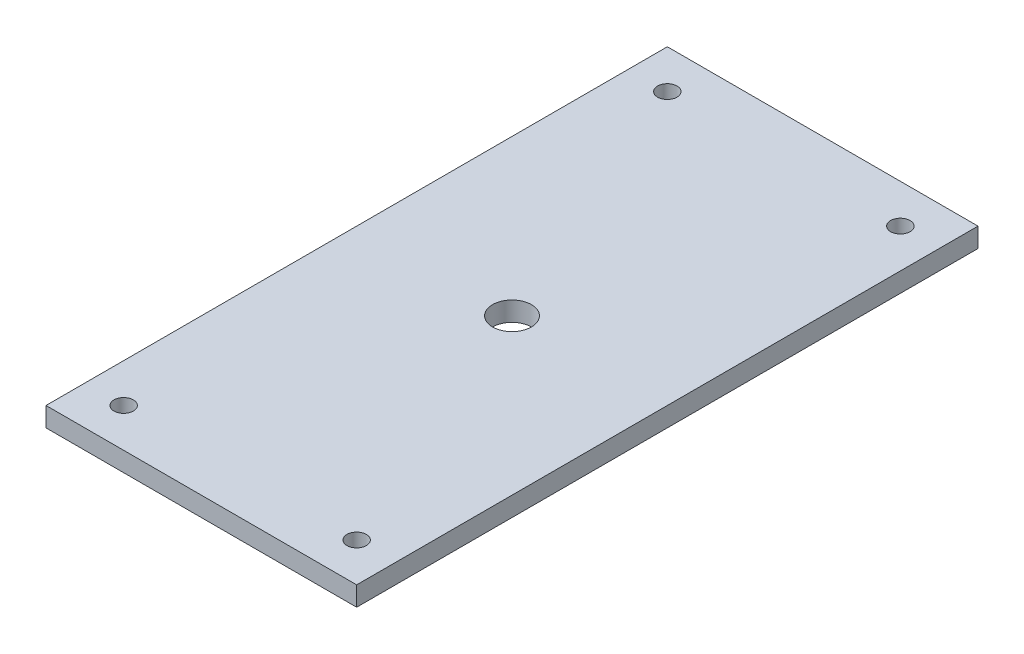
ISO-10303-21;
HEADER;
FILE_DESCRIPTION(('STEP AP214'),'2;1');
FILE_NAME('part.step','',(''),(''),'','','');
FILE_SCHEMA(('AUTOMOTIVE_DESIGN { 1 0 10303 214 1 1 1 1 }'));
ENDSEC;
DATA;
#1=APPLICATION_CONTEXT('core data for automotive mechanical design processes');
#2=APPLICATION_PROTOCOL_DEFINITION('international standard','automotive_design',2000,#1);
#3=PRODUCT_CONTEXT('',#1,'mechanical');
#4=PRODUCT('Part','Part','',(#3));
#5=PRODUCT_RELATED_PRODUCT_CATEGORY('part','',(#4));
#6=PRODUCT_DEFINITION_FORMATION('','',#4);
#7=PRODUCT_DEFINITION_CONTEXT('part definition',#1,'design');
#8=PRODUCT_DEFINITION('design','',#6,#7);
#9=PRODUCT_DEFINITION_SHAPE('','',#8);
#10=(LENGTH_UNIT() NAMED_UNIT(*) SI_UNIT(.MILLI.,.METRE.));
#11=(NAMED_UNIT(*) PLANE_ANGLE_UNIT() SI_UNIT($,.RADIAN.));
#12=(NAMED_UNIT(*) SI_UNIT($,.STERADIAN.) SOLID_ANGLE_UNIT());
#13=UNCERTAINTY_MEASURE_WITH_UNIT(LENGTH_MEASURE(1.E-05),#10,'distance_accuracy_value','');
#14=(GEOMETRIC_REPRESENTATION_CONTEXT(3) GLOBAL_UNCERTAINTY_ASSIGNED_CONTEXT((#13)) GLOBAL_UNIT_ASSIGNED_CONTEXT((#10,
#11,#12)) REPRESENTATION_CONTEXT('',''));
#15=CARTESIAN_POINT('',(0.,0.,0.));
#16=DIRECTION('',(0.,0.,1.));
#17=DIRECTION('',(1.,0.,0.));
#18=AXIS2_PLACEMENT_3D('',#15,#16,#17);
#19=CARTESIAN_POINT('',(0.,3.175,0.));
#20=DIRECTION('',(0.,-1.,0.));
#21=DIRECTION('',(0.,0.,-1.));
#22=AXIS2_PLACEMENT_3D('',#19,#20,#21);
#23=PLANE('',#22);
#24=CARTESIAN_POINT('',(-6.35,3.175,-95.25));
#25=DIRECTION('',(0.,1.,0.));
#26=DIRECTION('',(0.,0.,-1.));
#27=AXIS2_PLACEMENT_3D('',#24,#25,#26);
#28=CIRCLE('',#27,1.5875);
#29=CARTESIAN_POINT('',(-6.35,3.175,-96.8375));
#30=VERTEX_POINT('',#29);
#31=EDGE_CURVE('E157',#30,#30,#28,.T.);
#32=ORIENTED_EDGE('',*,*,#31,.F.);
#33=EDGE_LOOP('',(#32));
#34=FACE_BOUND('',#33,.T.);
#35=CARTESIAN_POINT('',(-44.45,3.175,-6.34999999999999));
#36=DIRECTION('',(0.,1.,0.));
#37=DIRECTION('',(0.,0.,-1.));
#38=AXIS2_PLACEMENT_3D('',#35,#36,#37);
#39=CIRCLE('',#38,1.5875);
#40=CARTESIAN_POINT('',(-44.45,3.175,-7.93749999999999));
#41=VERTEX_POINT('',#40);
#42=EDGE_CURVE('E142',#41,#41,#39,.T.);
#43=ORIENTED_EDGE('',*,*,#42,.F.);
#44=EDGE_LOOP('',(#43));
#45=FACE_BOUND('',#44,.T.);
#46=DIRECTION('',(1.,0.,0.));
#47=VECTOR('',#46,1.);
#48=CARTESIAN_POINT('',(0.,3.175,0.));
#49=LINE('',#48,#47);
#50=CARTESIAN_POINT('',(-50.8,3.175,0.));
#51=VERTEX_POINT('',#50);
#52=CARTESIAN_POINT('',(0.,3.175,0.));
#53=VERTEX_POINT('',#52);
#54=EDGE_CURVE('E99',#51,#53,#49,.T.);
#55=ORIENTED_EDGE('',*,*,#54,.T.);
#56=DIRECTION('',(0.,0.,-1.));
#57=VECTOR('',#56,1.);
#58=CARTESIAN_POINT('',(0.,3.175,0.));
#59=LINE('',#58,#57);
#60=CARTESIAN_POINT('',(0.,3.175,-101.6));
#61=VERTEX_POINT('',#60);
#62=EDGE_CURVE('E94',#53,#61,#59,.T.);
#63=ORIENTED_EDGE('',*,*,#62,.T.);
#64=DIRECTION('',(-1.,0.,0.));
#65=VECTOR('',#64,1.);
#66=CARTESIAN_POINT('',(0.,3.175,-101.6));
#67=LINE('',#66,#65);
#68=CARTESIAN_POINT('',(-50.8,3.175,-101.6));
#69=VERTEX_POINT('',#68);
#70=EDGE_CURVE('E97',#61,#69,#67,.T.);
#71=ORIENTED_EDGE('',*,*,#70,.T.);
#72=DIRECTION('',(0.,0.,1.));
#73=VECTOR('',#72,1.);
#74=CARTESIAN_POINT('',(-50.8,3.175,0.));
#75=LINE('',#74,#73);
#76=EDGE_CURVE('E59',#69,#51,#75,.T.);
#77=ORIENTED_EDGE('',*,*,#76,.T.);
#78=EDGE_LOOP('',(#55,#63,#71,#77));
#79=FACE_BOUND('',#78,.T.);
#80=CARTESIAN_POINT('',(-44.45,3.175,-95.25));
#81=DIRECTION('',(0.,1.,0.));
#82=DIRECTION('',(0.,0.,1.));
#83=AXIS2_PLACEMENT_3D('',#80,#81,#82);
#84=CIRCLE('',#83,1.5875);
#85=CARTESIAN_POINT('',(-44.45,3.175,-93.6625));
#86=VERTEX_POINT('',#85);
#87=EDGE_CURVE('E121',#86,#86,#84,.T.);
#88=ORIENTED_EDGE('',*,*,#87,.F.);
#89=EDGE_LOOP('',(#88));
#90=FACE_BOUND('',#89,.T.);
#91=CARTESIAN_POINT('',(-6.34999999999999,3.175,-6.35));
#92=DIRECTION('',(0.,1.,0.));
#93=DIRECTION('',(0.,0.,1.));
#94=AXIS2_PLACEMENT_3D('',#91,#92,#93);
#95=CIRCLE('',#94,1.5875);
#96=CARTESIAN_POINT('',(-6.34999999999999,3.175,-4.7625));
#97=VERTEX_POINT('',#96);
#98=EDGE_CURVE('E150',#97,#97,#95,.T.);
#99=ORIENTED_EDGE('',*,*,#98,.F.);
#100=EDGE_LOOP('',(#99));
#101=FACE_BOUND('',#100,.T.);
#102=CARTESIAN_POINT('',(-25.4,3.175,-50.8));
#103=DIRECTION('',(0.,1.,0.));
#104=DIRECTION('',(0.,0.,1.));
#105=AXIS2_PLACEMENT_3D('',#102,#103,#104);
#106=CIRCLE('',#105,3.175);
#107=CARTESIAN_POINT('',(-25.4,3.175,-47.625));
#108=VERTEX_POINT('',#107);
#109=EDGE_CURVE('E165',#108,#108,#106,.T.);
#110=ORIENTED_EDGE('',*,*,#109,.F.);
#111=EDGE_LOOP('',(#110));
#112=FACE_BOUND('',#111,.T.);
#113=ADVANCED_FACE('F38',(#34,#45,#79,#90,#101,#112),#23,.F.);
#114=CARTESIAN_POINT('',(0.,0.,0.));
#115=DIRECTION('',(0.,-1.,0.));
#116=DIRECTION('',(0.,0.,-1.));
#117=AXIS2_PLACEMENT_3D('',#114,#115,#116);
#118=PLANE('',#117);
#119=CARTESIAN_POINT('',(-6.35,0.,-95.25));
#120=DIRECTION('',(0.,1.,0.));
#121=DIRECTION('',(0.,0.,-1.));
#122=AXIS2_PLACEMENT_3D('',#119,#120,#121);
#123=CIRCLE('',#122,1.5875);
#124=CARTESIAN_POINT('',(-6.35,0.,-96.8375));
#125=VERTEX_POINT('',#124);
#126=EDGE_CURVE('E161',#125,#125,#123,.T.);
#127=ORIENTED_EDGE('',*,*,#126,.T.);
#128=EDGE_LOOP('',(#127));
#129=FACE_BOUND('',#128,.T.);
#130=CARTESIAN_POINT('',(-44.45,0.,-6.34999999999999));
#131=DIRECTION('',(0.,1.,0.));
#132=DIRECTION('',(0.,0.,-1.));
#133=AXIS2_PLACEMENT_3D('',#130,#131,#132);
#134=CIRCLE('',#133,1.5875);
#135=CARTESIAN_POINT('',(-44.45,0.,-7.93749999999999));
#136=VERTEX_POINT('',#135);
#137=EDGE_CURVE('E146',#136,#136,#134,.T.);
#138=ORIENTED_EDGE('',*,*,#137,.T.);
#139=EDGE_LOOP('',(#138));
#140=FACE_BOUND('',#139,.T.);
#141=DIRECTION('',(1.,0.,0.));
#142=VECTOR('',#141,1.);
#143=CARTESIAN_POINT('',(0.,0.,0.));
#144=LINE('',#143,#142);
#145=CARTESIAN_POINT('',(-50.8,0.,0.));
#146=VERTEX_POINT('',#145);
#147=CARTESIAN_POINT('',(0.,0.,0.));
#148=VERTEX_POINT('',#147);
#149=EDGE_CURVE('E117',#146,#148,#144,.T.);
#150=ORIENTED_EDGE('',*,*,#149,.F.);
#151=DIRECTION('',(0.,0.,1.));
#152=VECTOR('',#151,1.);
#153=CARTESIAN_POINT('',(-50.8,0.,0.));
#154=LINE('',#153,#152);
#155=CARTESIAN_POINT('',(-50.8,0.,-101.6));
#156=VERTEX_POINT('',#155);
#157=EDGE_CURVE('E86',#156,#146,#154,.T.);
#158=ORIENTED_EDGE('',*,*,#157,.F.);
#159=DIRECTION('',(-1.,0.,0.));
#160=VECTOR('',#159,1.);
#161=CARTESIAN_POINT('',(0.,0.,-101.6));
#162=LINE('',#161,#160);
#163=CARTESIAN_POINT('',(0.,0.,-101.6));
#164=VERTEX_POINT('',#163);
#165=EDGE_CURVE('E80',#164,#156,#162,.T.);
#166=ORIENTED_EDGE('',*,*,#165,.F.);
#167=DIRECTION('',(0.,0.,-1.));
#168=VECTOR('',#167,1.);
#169=CARTESIAN_POINT('',(0.,0.,0.));
#170=LINE('',#169,#168);
#171=EDGE_CURVE('E104',#148,#164,#170,.T.);
#172=ORIENTED_EDGE('',*,*,#171,.F.);
#173=EDGE_LOOP('',(#150,#158,#166,#172));
#174=FACE_BOUND('',#173,.T.);
#175=CARTESIAN_POINT('',(-44.45,0.,-95.25));
#176=DIRECTION('',(0.,1.,0.));
#177=DIRECTION('',(0.,0.,1.));
#178=AXIS2_PLACEMENT_3D('',#175,#176,#177);
#179=CIRCLE('',#178,1.5875);
#180=CARTESIAN_POINT('',(-44.45,0.,-93.6625));
#181=VERTEX_POINT('',#180);
#182=EDGE_CURVE('E138',#181,#181,#179,.T.);
#183=ORIENTED_EDGE('',*,*,#182,.T.);
#184=EDGE_LOOP('',(#183));
#185=FACE_BOUND('',#184,.T.);
#186=CARTESIAN_POINT('',(-6.34999999999999,0.,-6.35));
#187=DIRECTION('',(0.,1.,0.));
#188=DIRECTION('',(0.,0.,1.));
#189=AXIS2_PLACEMENT_3D('',#186,#187,#188);
#190=CIRCLE('',#189,1.5875);
#191=CARTESIAN_POINT('',(-6.34999999999999,0.,-4.7625));
#192=VERTEX_POINT('',#191);
#193=EDGE_CURVE('E154',#192,#192,#190,.T.);
#194=ORIENTED_EDGE('',*,*,#193,.T.);
#195=EDGE_LOOP('',(#194));
#196=FACE_BOUND('',#195,.T.);
#197=CARTESIAN_POINT('',(-25.4,0.,-50.8));
#198=DIRECTION('',(0.,1.,0.));
#199=DIRECTION('',(0.,0.,1.));
#200=AXIS2_PLACEMENT_3D('',#197,#198,#199);
#201=CIRCLE('',#200,3.175);
#202=CARTESIAN_POINT('',(-25.4,0.,-47.625));
#203=VERTEX_POINT('',#202);
#204=EDGE_CURVE('E169',#203,#203,#201,.T.);
#205=ORIENTED_EDGE('',*,*,#204,.T.);
#206=EDGE_LOOP('',(#205));
#207=FACE_BOUND('',#206,.T.);
#208=ADVANCED_FACE('F133',(#129,#140,#174,#185,#196,#207),#118,.T.);
#209=CARTESIAN_POINT('',(0.,3.175,0.));
#210=DIRECTION('',(0.,0.,-1.));
#211=DIRECTION('',(-1.,0.,0.));
#212=AXIS2_PLACEMENT_3D('',#209,#210,#211);
#213=PLANE('',#212);
#214=ORIENTED_EDGE('',*,*,#149,.T.);
#215=DIRECTION('',(0.,-1.,0.));
#216=VECTOR('',#215,1.);
#217=CARTESIAN_POINT('',(0.,3.175,0.));
#218=LINE('',#217,#216);
#219=EDGE_CURVE('E11',#53,#148,#218,.T.);
#220=ORIENTED_EDGE('',*,*,#219,.F.);
#221=ORIENTED_EDGE('',*,*,#54,.F.);
#222=DIRECTION('',(0.,-1.,0.));
#223=VECTOR('',#222,1.);
#224=CARTESIAN_POINT('',(-50.8,3.175,0.));
#225=LINE('',#224,#223);
#226=EDGE_CURVE('E113',#51,#146,#225,.T.);
#227=ORIENTED_EDGE('',*,*,#226,.T.);
#228=EDGE_LOOP('',(#214,#220,#221,#227));
#229=FACE_BOUND('',#228,.T.);
#230=ADVANCED_FACE('F40',(#229),#213,.F.);
#231=CARTESIAN_POINT('',(0.,3.175,0.));
#232=DIRECTION('',(-1.,0.,0.));
#233=DIRECTION('',(0.,0.,1.));
#234=AXIS2_PLACEMENT_3D('',#231,#232,#233);
#235=PLANE('',#234);
#236=ORIENTED_EDGE('',*,*,#171,.T.);
#237=DIRECTION('',(0.,-1.,0.));
#238=VECTOR('',#237,1.);
#239=CARTESIAN_POINT('',(0.,3.175,-101.6));
#240=LINE('',#239,#238);
#241=EDGE_CURVE('E48',#61,#164,#240,.T.);
#242=ORIENTED_EDGE('',*,*,#241,.F.);
#243=ORIENTED_EDGE('',*,*,#62,.F.);
#244=ORIENTED_EDGE('',*,*,#219,.T.);
#245=EDGE_LOOP('',(#236,#242,#243,#244));
#246=FACE_BOUND('',#245,.T.);
#247=ADVANCED_FACE('F103',(#246),#235,.F.);
#248=CARTESIAN_POINT('',(0.,3.175,-101.6));
#249=DIRECTION('',(0.,0.,1.));
#250=DIRECTION('',(1.,0.,0.));
#251=AXIS2_PLACEMENT_3D('',#248,#249,#250);
#252=PLANE('',#251);
#253=ORIENTED_EDGE('',*,*,#165,.T.);
#254=DIRECTION('',(0.,-1.,0.));
#255=VECTOR('',#254,1.);
#256=CARTESIAN_POINT('',(-50.8,3.175,-101.6));
#257=LINE('',#256,#255);
#258=EDGE_CURVE('E106',#69,#156,#257,.T.);
#259=ORIENTED_EDGE('',*,*,#258,.F.);
#260=ORIENTED_EDGE('',*,*,#70,.F.);
#261=ORIENTED_EDGE('',*,*,#241,.T.);
#262=EDGE_LOOP('',(#253,#259,#260,#261));
#263=FACE_BOUND('',#262,.T.);
#264=ADVANCED_FACE('F107',(#263),#252,.F.);
#265=CARTESIAN_POINT('',(-50.8,3.175,0.));
#266=DIRECTION('',(1.,0.,0.));
#267=DIRECTION('',(0.,0.,-1.));
#268=AXIS2_PLACEMENT_3D('',#265,#266,#267);
#269=PLANE('',#268);
#270=ORIENTED_EDGE('',*,*,#157,.T.);
#271=ORIENTED_EDGE('',*,*,#226,.F.);
#272=ORIENTED_EDGE('',*,*,#76,.F.);
#273=ORIENTED_EDGE('',*,*,#258,.T.);
#274=EDGE_LOOP('',(#270,#271,#272,#273));
#275=FACE_BOUND('',#274,.T.);
#276=ADVANCED_FACE('F130',(#275),#269,.F.);
#277=CARTESIAN_POINT('',(-44.45,3.175,-95.25));
#278=DIRECTION('',(0.,-1.,0.));
#279=DIRECTION('',(0.,0.,-1.));
#280=AXIS2_PLACEMENT_3D('',#277,#278,#279);
#281=CYLINDRICAL_SURFACE('',#280,1.5875);
#282=ORIENTED_EDGE('',*,*,#87,.T.);
#283=EDGE_LOOP('',(#282));
#284=FACE_BOUND('',#283,.T.);
#285=ORIENTED_EDGE('',*,*,#182,.F.);
#286=EDGE_LOOP('',(#285));
#287=FACE_BOUND('',#286,.T.);
#288=ADVANCED_FACE('F191',(#284,#287),#281,.F.);
#289=CARTESIAN_POINT('',(-44.45,3.175,-6.34999999999999));
#290=DIRECTION('',(0.,-1.,0.));
#291=DIRECTION('',(0.,0.,-1.));
#292=AXIS2_PLACEMENT_3D('',#289,#290,#291);
#293=CYLINDRICAL_SURFACE('',#292,1.5875);
#294=ORIENTED_EDGE('',*,*,#42,.T.);
#295=EDGE_LOOP('',(#294));
#296=FACE_BOUND('',#295,.T.);
#297=ORIENTED_EDGE('',*,*,#137,.F.);
#298=EDGE_LOOP('',(#297));
#299=FACE_BOUND('',#298,.T.);
#300=ADVANCED_FACE('F239',(#296,#299),#293,.F.);
#301=CARTESIAN_POINT('',(-6.34999999999999,3.175,-6.35));
#302=DIRECTION('',(0.,-1.,0.));
#303=DIRECTION('',(0.,0.,-1.));
#304=AXIS2_PLACEMENT_3D('',#301,#302,#303);
#305=CYLINDRICAL_SURFACE('',#304,1.5875);
#306=ORIENTED_EDGE('',*,*,#98,.T.);
#307=EDGE_LOOP('',(#306));
#308=FACE_BOUND('',#307,.T.);
#309=ORIENTED_EDGE('',*,*,#193,.F.);
#310=EDGE_LOOP('',(#309));
#311=FACE_BOUND('',#310,.T.);
#312=ADVANCED_FACE('F247',(#308,#311),#305,.F.);
#313=CARTESIAN_POINT('',(-6.35,3.175,-95.25));
#314=DIRECTION('',(0.,-1.,0.));
#315=DIRECTION('',(0.,0.,-1.));
#316=AXIS2_PLACEMENT_3D('',#313,#314,#315);
#317=CYLINDRICAL_SURFACE('',#316,1.5875);
#318=ORIENTED_EDGE('',*,*,#31,.T.);
#319=EDGE_LOOP('',(#318));
#320=FACE_BOUND('',#319,.T.);
#321=ORIENTED_EDGE('',*,*,#126,.F.);
#322=EDGE_LOOP('',(#321));
#323=FACE_BOUND('',#322,.T.);
#324=ADVANCED_FACE('F255',(#320,#323),#317,.F.);
#325=CARTESIAN_POINT('',(-25.4,3.175,-50.8));
#326=DIRECTION('',(0.,-1.,0.));
#327=DIRECTION('',(0.,0.,-1.));
#328=AXIS2_PLACEMENT_3D('',#325,#326,#327);
#329=CYLINDRICAL_SURFACE('',#328,3.175);
#330=ORIENTED_EDGE('',*,*,#109,.T.);
#331=EDGE_LOOP('',(#330));
#332=FACE_BOUND('',#331,.T.);
#333=ORIENTED_EDGE('',*,*,#204,.F.);
#334=EDGE_LOOP('',(#333));
#335=FACE_BOUND('',#334,.T.);
#336=ADVANCED_FACE('F177',(#332,#335),#329,.F.);
#337=CLOSED_SHELL('',(#113,#208,#230,#247,#264,#276,#288,#300,#312,#324,#336));
#338=MANIFOLD_SOLID_BREP('B2',#337);
#339=ADVANCED_BREP_SHAPE_REPRESENTATION('',(#18,#338),#14);
#340=SHAPE_DEFINITION_REPRESENTATION(#9,#339);
ENDSEC;
END-ISO-10303-21;
